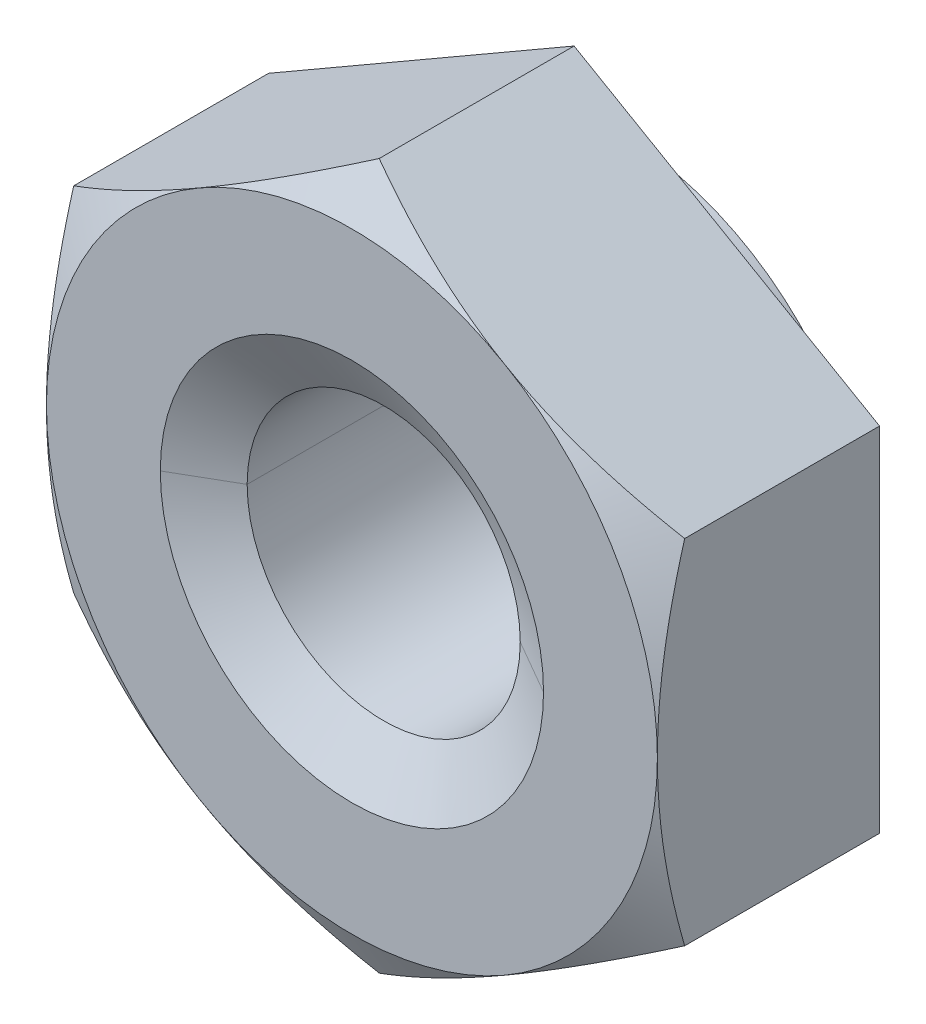
ISO-10303-21;
HEADER;
FILE_DESCRIPTION(('STEP AP214'),'2;1');
FILE_NAME('part.step','',(''),(''),'','','');
FILE_SCHEMA(('AUTOMOTIVE_DESIGN { 1 0 10303 214 1 1 1 1 }'));
ENDSEC;
DATA;
#1=APPLICATION_CONTEXT('core data for automotive mechanical design processes');
#2=APPLICATION_PROTOCOL_DEFINITION('international standard','automotive_design',2000,#1);
#3=PRODUCT_CONTEXT('',#1,'mechanical');
#4=PRODUCT('Part','Part','',(#3));
#5=PRODUCT_RELATED_PRODUCT_CATEGORY('part','',(#4));
#6=PRODUCT_DEFINITION_FORMATION('','',#4);
#7=PRODUCT_DEFINITION_CONTEXT('part definition',#1,'design');
#8=PRODUCT_DEFINITION('design','',#6,#7);
#9=PRODUCT_DEFINITION_SHAPE('','',#8);
#10=(LENGTH_UNIT() NAMED_UNIT(*) SI_UNIT(.MILLI.,.METRE.));
#11=(NAMED_UNIT(*) PLANE_ANGLE_UNIT() SI_UNIT($,.RADIAN.));
#12=(NAMED_UNIT(*) SI_UNIT($,.STERADIAN.) SOLID_ANGLE_UNIT());
#13=UNCERTAINTY_MEASURE_WITH_UNIT(LENGTH_MEASURE(1.E-05),#10,'distance_accuracy_value','');
#14=(GEOMETRIC_REPRESENTATION_CONTEXT(3) GLOBAL_UNCERTAINTY_ASSIGNED_CONTEXT((#13)) GLOBAL_UNIT_ASSIGNED_CONTEXT((#10,
#11,#12)) REPRESENTATION_CONTEXT('',''));
#15=CARTESIAN_POINT('',(0.,0.,0.));
#16=DIRECTION('',(0.,0.,1.));
#17=DIRECTION('',(1.,0.,0.));
#18=AXIS2_PLACEMENT_3D('',#15,#16,#17);
#19=CARTESIAN_POINT('',(0.,-2.3,-2.));
#20=DIRECTION('',(0.,0.,-1.));
#21=DIRECTION('',(0.,-1.,0.));
#22=AXIS2_PLACEMENT_3D('',#19,#20,#21);
#23=PLANE('',#22);
#24=CARTESIAN_POINT('',(0.,0.,-2.));
#25=DIRECTION('',(0.,0.,1.));
#26=DIRECTION('',(1.,0.,0.));
#27=AXIS2_PLACEMENT_3D('',#24,#25,#26);
#28=CIRCLE('',#27,2.3);
#29=CARTESIAN_POINT('',(2.3,0.,-2.));
#30=VERTEX_POINT('',#29);
#31=CARTESIAN_POINT('',(-2.3,0.,-2.));
#32=VERTEX_POINT('',#31);
#33=EDGE_CURVE('E428',#30,#32,#28,.T.);
#34=ORIENTED_EDGE('',*,*,#33,.T.);
#35=CARTESIAN_POINT('',(0.,0.,-2.));
#36=DIRECTION('',(0.,0.,1.));
#37=DIRECTION('',(1.,0.,0.));
#38=AXIS2_PLACEMENT_3D('',#35,#36,#37);
#39=CIRCLE('',#38,2.3);
#40=EDGE_CURVE('E11',#32,#30,#39,.T.);
#41=ORIENTED_EDGE('',*,*,#40,.T.);
#42=EDGE_LOOP('',(#34,#41));
#43=FACE_BOUND('',#42,.T.);
#44=DIRECTION('',(0.,1.,0.));
#45=VECTOR('',#44,1.);
#46=CARTESIAN_POINT('',(2.75,-1.58771324027147,-2.));
#47=LINE('',#46,#45);
#48=CARTESIAN_POINT('',(2.75,-1.58771324027148,-2.));
#49=VERTEX_POINT('',#48);
#50=CARTESIAN_POINT('',(2.75,1.58771324027146,-2.));
#51=VERTEX_POINT('',#50);
#52=EDGE_CURVE('E395',#49,#51,#47,.T.);
#53=ORIENTED_EDGE('',*,*,#52,.F.);
#54=DIRECTION('',(0.86602540378444,0.5,0.));
#55=VECTOR('',#54,1.);
#56=CARTESIAN_POINT('',(0.,-3.17542648054294,-2.));
#57=LINE('',#56,#55);
#58=CARTESIAN_POINT('',(0.,-3.17542648054294,-2.));
#59=VERTEX_POINT('',#58);
#60=EDGE_CURVE('E225',#59,#49,#57,.T.);
#61=ORIENTED_EDGE('',*,*,#60,.F.);
#62=DIRECTION('',(0.866025403784437,-0.5,0.));
#63=VECTOR('',#62,1.);
#64=CARTESIAN_POINT('',(-2.75,-1.58771324027146,-2.));
#65=LINE('',#64,#63);
#66=CARTESIAN_POINT('',(-2.75,-1.58771324027146,-2.));
#67=VERTEX_POINT('',#66);
#68=EDGE_CURVE('E205',#67,#59,#65,.T.);
#69=ORIENTED_EDGE('',*,*,#68,.F.);
#70=DIRECTION('',(0.,-1.,0.));
#71=VECTOR('',#70,1.);
#72=CARTESIAN_POINT('',(-2.75,1.58771324027148,-2.));
#73=LINE('',#72,#71);
#74=CARTESIAN_POINT('',(-2.75,1.58771324027148,-2.));
#75=VERTEX_POINT('',#74);
#76=EDGE_CURVE('E482',#75,#67,#73,.T.);
#77=ORIENTED_EDGE('',*,*,#76,.F.);
#78=DIRECTION('',(-0.86602540378444,-0.5,0.));
#79=VECTOR('',#78,1.);
#80=CARTESIAN_POINT('',(0.,3.17542648054294,-2.));
#81=LINE('',#80,#79);
#82=CARTESIAN_POINT('',(0.,3.17542648054294,-2.));
#83=VERTEX_POINT('',#82);
#84=EDGE_CURVE('E107',#83,#75,#81,.T.);
#85=ORIENTED_EDGE('',*,*,#84,.F.);
#86=DIRECTION('',(-0.866025403784437,0.5,0.));
#87=VECTOR('',#86,1.);
#88=CARTESIAN_POINT('',(2.75,1.58771324027145,-2.));
#89=LINE('',#88,#87);
#90=EDGE_CURVE('E396',#51,#83,#89,.T.);
#91=ORIENTED_EDGE('',*,*,#90,.F.);
#92=EDGE_LOOP('',(#53,#61,#69,#77,#85,#91));
#93=FACE_BOUND('',#92,.T.);
#94=ADVANCED_FACE('F17',(#43,#93),#23,.T.);
#95=CARTESIAN_POINT('',(0.,0.,0.));
#96=DIRECTION('',(0.,0.,1.));
#97=DIRECTION('',(1.,0.,0.));
#98=AXIS2_PLACEMENT_3D('',#95,#96,#97);
#99=CYLINDRICAL_SURFACE('',#98,2.3);
#100=DIRECTION('',(0.,0.,1.));
#101=VECTOR('',#100,1.);
#102=CARTESIAN_POINT('',(-2.3,0.,0.));
#103=LINE('',#102,#101);
#104=CARTESIAN_POINT('',(-2.3,0.,-2.4));
#105=VERTEX_POINT('',#104);
#106=EDGE_CURVE('E424',#105,#32,#103,.T.);
#107=ORIENTED_EDGE('',*,*,#106,.F.);
#108=CARTESIAN_POINT('',(0.,0.,-2.4));
#109=DIRECTION('',(0.,0.,1.));
#110=DIRECTION('',(1.,0.,0.));
#111=AXIS2_PLACEMENT_3D('',#108,#109,#110);
#112=CIRCLE('',#111,2.3);
#113=CARTESIAN_POINT('',(2.3,0.,-2.4));
#114=VERTEX_POINT('',#113);
#115=EDGE_CURVE('E433',#105,#114,#112,.T.);
#116=ORIENTED_EDGE('',*,*,#115,.T.);
#117=DIRECTION('',(0.,0.,1.));
#118=VECTOR('',#117,1.);
#119=CARTESIAN_POINT('',(2.3,0.,0.));
#120=LINE('',#119,#118);
#121=EDGE_CURVE('E873',#114,#30,#120,.T.);
#122=ORIENTED_EDGE('',*,*,#121,.T.);
#123=ORIENTED_EDGE('',*,*,#40,.F.);
#124=EDGE_LOOP('',(#107,#116,#122,#123));
#125=FACE_BOUND('',#124,.T.);
#126=ADVANCED_FACE('F344',(#125),#99,.T.);
#127=CARTESIAN_POINT('',(0.,0.,0.));
#128=DIRECTION('',(0.,0.,-1.));
#129=DIRECTION('',(1.,0.,0.));
#130=AXIS2_PLACEMENT_3D('',#127,#128,#129);
#131=CONICAL_SURFACE('',#130,2.75,1.0471975511966);
#132=CARTESIAN_POINT('',(0.,0.,0.));
#133=DIRECTION('',(0.,0.,1.));
#134=DIRECTION('',(1.,0.,0.));
#135=AXIS2_PLACEMENT_3D('',#132,#133,#134);
#136=CIRCLE('',#135,2.75);
#137=CARTESIAN_POINT('',(2.75,0.,0.));
#138=VERTEX_POINT('',#137);
#139=CARTESIAN_POINT('',(1.375,2.3815698604072,0.));
#140=VERTEX_POINT('',#139);
#141=EDGE_CURVE('E271',#138,#140,#136,.T.);
#142=ORIENTED_EDGE('',*,*,#141,.F.);
#143=CARTESIAN_POINT('',(2.75000000000001,1.58771324027145,-0.24562009306186));
#144=CARTESIAN_POINT('',(2.75000000000001,1.17700711208503,-0.127059446228729));
#145=CARTESIAN_POINT('',(2.75000000000001,0.80581810971201,-0.0667597700795448));
#146=CARTESIAN_POINT('',(2.75000000000001,0.39486246223607,0.));
#147=CARTESIAN_POINT('',(2.75000000000001,0.,0.));
#148=B_SPLINE_CURVE_WITH_KNOTS('',2,(#143,#144,#145,#146,#147),.UNSPECIFIED.,.F.,.F.,(3,2,3),
(0.,0.5,1.),.UNSPECIFIED.);
#149=CARTESIAN_POINT('',(2.75,1.58771324027145,-0.245620093061859));
#150=VERTEX_POINT('',#149);
#151=EDGE_CURVE('E236',#150,#138,#148,.T.);
#152=ORIENTED_EDGE('',*,*,#151,.F.);
#153=CARTESIAN_POINT('',(1.37499999999999,2.38156986040719,0.));
#154=CARTESIAN_POINT('',(1.71537571429377,2.18505385013407,0.));
#155=CARTESIAN_POINT('',(2.07042661145691,1.98006511908091,-0.0663045175160796));
#156=CARTESIAN_POINT('',(2.39248072027393,1.79412709266178,-0.126446999818754));
#157=CARTESIAN_POINT('',(2.75,1.58771324027145,-0.24562009306186));
#158=B_SPLINE_CURVE_WITH_KNOTS('',2,(#153,#154,#155,#156,#157),.UNSPECIFIED.,.F.,.F.,(3,2,3),
(0.,0.5,1.),.UNSPECIFIED.);
#159=EDGE_CURVE('E387',#140,#150,#158,.T.);
#160=ORIENTED_EDGE('',*,*,#159,.F.);
#161=EDGE_LOOP('',(#142,#152,#160));
#162=FACE_BOUND('',#161,.T.);
#163=ADVANCED_FACE('F335',(#162),#131,.T.);
#164=CARTESIAN_POINT('',(0.,0.,0.));
#165=DIRECTION('',(0.,0.,-1.));
#166=DIRECTION('',(1.,0.,0.));
#167=AXIS2_PLACEMENT_3D('',#164,#165,#166);
#168=CONICAL_SURFACE('',#167,2.75,1.0471975511966);
#169=CARTESIAN_POINT('',(0.,0.,0.));
#170=DIRECTION('',(0.,0.,1.));
#171=DIRECTION('',(1.,0.,0.));
#172=AXIS2_PLACEMENT_3D('',#169,#170,#171);
#173=CIRCLE('',#172,2.75);
#174=CARTESIAN_POINT('',(1.375,-2.38156986040721,0.));
#175=VERTEX_POINT('',#174);
#176=EDGE_CURVE('E262',#175,#138,#173,.T.);
#177=ORIENTED_EDGE('',*,*,#176,.F.);
#178=CARTESIAN_POINT('',(2.75,-1.58771324027147,-0.24562009306186));
#179=CARTESIAN_POINT('',(2.01313972082094,-2.01313972081064,0.));
#180=CARTESIAN_POINT('',(1.37499999999999,-2.3815698604072,0.));
#181=B_SPLINE_CURVE_WITH_KNOTS('',2,(#178,#179,#180),.UNSPECIFIED.,.F.,.F.,(3,3),(0.,1.),.UNSPECIFIED.);
#182=CARTESIAN_POINT('',(2.75,-1.58771324027147,-0.245620093061859));
#183=VERTEX_POINT('',#182);
#184=EDGE_CURVE('E214',#183,#175,#181,.T.);
#185=ORIENTED_EDGE('',*,*,#184,.F.);
#186=CARTESIAN_POINT('',(2.75000000000001,0.,0.));
#187=CARTESIAN_POINT('',(2.75,-0.391595094571537,0.));
#188=CARTESIAN_POINT('',(2.75,-0.799945605578829,-0.0658095618981747));
#189=CARTESIAN_POINT('',(2.75,-1.17322057595631,-0.125966367402105));
#190=CARTESIAN_POINT('',(2.75,-1.58771324027147,-0.24562009306186));
#191=B_SPLINE_CURVE_WITH_KNOTS('',2,(#186,#187,#188,#189,#190),.UNSPECIFIED.,.F.,.F.,(3,2,3),
(0.,0.5,1.),.UNSPECIFIED.);
#192=EDGE_CURVE('E226',#138,#183,#191,.T.);
#193=ORIENTED_EDGE('',*,*,#192,.F.);
#194=EDGE_LOOP('',(#177,#185,#193));
#195=FACE_BOUND('',#194,.T.);
#196=ADVANCED_FACE('F251',(#195),#168,.T.);
#197=CARTESIAN_POINT('',(0.,0.,0.));
#198=DIRECTION('',(0.,0.,-1.));
#199=DIRECTION('',(1.,0.,0.));
#200=AXIS2_PLACEMENT_3D('',#197,#198,#199);
#201=CONICAL_SURFACE('',#200,2.75,1.0471975511966);
#202=CARTESIAN_POINT('',(0.,0.,0.));
#203=DIRECTION('',(0.,0.,1.));
#204=DIRECTION('',(1.,0.,0.));
#205=AXIS2_PLACEMENT_3D('',#202,#203,#204);
#206=CIRCLE('',#205,2.75);
#207=CARTESIAN_POINT('',(-1.375,-2.3815698604072,0.));
#208=VERTEX_POINT('',#207);
#209=EDGE_CURVE('E197',#208,#175,#206,.T.);
#210=ORIENTED_EDGE('',*,*,#209,.F.);
#211=CARTESIAN_POINT('',(0.,-3.17542648054293,-0.245620093061866));
#212=CARTESIAN_POINT('',(-0.736860279179043,-2.75000000000376,0.));
#213=CARTESIAN_POINT('',(-1.37499999999999,-2.3815698604072,0.));
#214=B_SPLINE_CURVE_WITH_KNOTS('',2,(#211,#212,#213),.UNSPECIFIED.,.F.,.F.,(3,3),(0.,1.),.UNSPECIFIED.);
#215=CARTESIAN_POINT('',(0.,-3.17542648054294,-0.245620093061859));
#216=VERTEX_POINT('',#215);
#217=EDGE_CURVE('E190',#216,#208,#214,.T.);
#218=ORIENTED_EDGE('',*,*,#217,.F.);
#219=CARTESIAN_POINT('',(1.37499999999999,-2.3815698604072,0.));
#220=CARTESIAN_POINT('',(1.03462428570698,-2.57808587067989,0.));
#221=CARTESIAN_POINT('',(0.679573388543084,-2.78307460173348,-0.0663045175160796));
#222=CARTESIAN_POINT('',(0.357519279726927,-2.96901262815211,-0.126446999818469));
#223=CARTESIAN_POINT('',(0.,-3.17542648054294,-0.24562009306186));
#224=B_SPLINE_CURVE_WITH_KNOTS('',2,(#219,#220,#221,#222,#223),.UNSPECIFIED.,.F.,.F.,(3,2,3),
(0.,0.5,1.),.UNSPECIFIED.);
#225=EDGE_CURVE('E194',#175,#216,#224,.T.);
#226=ORIENTED_EDGE('',*,*,#225,.F.);
#227=EDGE_LOOP('',(#210,#218,#226));
#228=FACE_BOUND('',#227,.T.);
#229=ADVANCED_FACE('F193',(#228),#201,.T.);
#230=CARTESIAN_POINT('',(0.,0.,0.));
#231=DIRECTION('',(0.,0.,-1.));
#232=DIRECTION('',(1.,0.,0.));
#233=AXIS2_PLACEMENT_3D('',#230,#231,#232);
#234=CONICAL_SURFACE('',#233,2.75,1.0471975511966);
#235=CARTESIAN_POINT('',(0.,0.,0.));
#236=DIRECTION('',(0.,0.,1.));
#237=DIRECTION('',(1.,0.,0.));
#238=AXIS2_PLACEMENT_3D('',#235,#236,#237);
#239=CIRCLE('',#238,2.75);
#240=CARTESIAN_POINT('',(-2.75,0.,0.));
#241=VERTEX_POINT('',#240);
#242=EDGE_CURVE('E550',#241,#208,#239,.T.);
#243=ORIENTED_EDGE('',*,*,#242,.F.);
#244=CARTESIAN_POINT('',(-2.75000000000001,-1.58771324027208,-0.245620093061445));
#245=CARTESIAN_POINT('',(-2.75000000000001,-1.17381427037922,-0.12613775221989));
#246=CARTESIAN_POINT('',(-2.75000000000001,-0.799945605579045,-0.0658095618982098));
#247=CARTESIAN_POINT('',(-2.75000000000001,-0.392107530099285,0.));
#248=CARTESIAN_POINT('',(-2.75000000000001,0.,0.));
#249=B_SPLINE_CURVE_WITH_KNOTS('',2,(#244,#245,#246,#247,#248),.UNSPECIFIED.,.F.,.F.,(3,2,3),
(0.,0.5,1.),.UNSPECIFIED.);
#250=CARTESIAN_POINT('',(-2.75,-1.58771324027208,-0.245620093061443));
#251=VERTEX_POINT('',#250);
#252=EDGE_CURVE('E516',#251,#241,#249,.T.);
#253=ORIENTED_EDGE('',*,*,#252,.F.);
#254=CARTESIAN_POINT('',(-1.37499999999999,-2.3815698604072,0.));
#255=CARTESIAN_POINT('',(-1.71537571429273,-2.18505385013467,0.));
#256=CARTESIAN_POINT('',(-2.07042661145675,-1.98006511908101,-0.0663045175160566));
#257=CARTESIAN_POINT('',(-2.39248072027127,-1.79412709266332,-0.126446999818092));
#258=CARTESIAN_POINT('',(-2.74999999999973,-1.58771324027161,-0.245620093061451));
#259=B_SPLINE_CURVE_WITH_KNOTS('',2,(#254,#255,#256,#257,#258),.UNSPECIFIED.,.F.,.F.,(3,2,3),
(0.,0.5,1.),.UNSPECIFIED.);
#260=EDGE_CURVE('E204',#208,#251,#259,.T.);
#261=ORIENTED_EDGE('',*,*,#260,.F.);
#262=EDGE_LOOP('',(#243,#253,#261));
#263=FACE_BOUND('',#262,.T.);
#264=ADVANCED_FACE('F250',(#263),#234,.T.);
#265=CARTESIAN_POINT('',(0.,0.,0.));
#266=DIRECTION('',(0.,0.,-1.));
#267=DIRECTION('',(1.,0.,0.));
#268=AXIS2_PLACEMENT_3D('',#265,#266,#267);
#269=CONICAL_SURFACE('',#268,2.75,1.0471975511966);
#270=CARTESIAN_POINT('',(0.,0.,0.));
#271=DIRECTION('',(0.,0.,1.));
#272=DIRECTION('',(1.,0.,0.));
#273=AXIS2_PLACEMENT_3D('',#270,#271,#272);
#274=CIRCLE('',#273,2.75);
#275=CARTESIAN_POINT('',(-1.375,2.38156986040721,0.));
#276=VERTEX_POINT('',#275);
#277=EDGE_CURVE('E45',#276,#241,#274,.T.);
#278=ORIENTED_EDGE('',*,*,#277,.F.);
#279=CARTESIAN_POINT('',(-2.75,1.58771324027147,-0.24562009306186));
#280=CARTESIAN_POINT('',(-2.01313972082094,2.01313972081064,0.));
#281=CARTESIAN_POINT('',(-1.375,2.38156986040721,0.));
#282=B_SPLINE_CURVE_WITH_KNOTS('',2,(#279,#280,#281),.UNSPECIFIED.,.F.,.F.,(3,3),(0.,1.),.UNSPECIFIED.);
#283=CARTESIAN_POINT('',(-2.75,1.58771324027148,-0.245620093061861));
#284=VERTEX_POINT('',#283);
#285=EDGE_CURVE('E468',#284,#276,#282,.T.);
#286=ORIENTED_EDGE('',*,*,#285,.F.);
#287=CARTESIAN_POINT('',(-2.75000000000001,0.,0.));
#288=CARTESIAN_POINT('',(-2.75,0.394350180617206,0.));
#289=CARTESIAN_POINT('',(-2.75,0.80581810971206,-0.06675977007955));
#290=CARTESIAN_POINT('',(-2.75,1.17641330303536,-0.126888028321385));
#291=CARTESIAN_POINT('',(-2.75,1.58771324027148,-0.24562009306186));
#292=B_SPLINE_CURVE_WITH_KNOTS('',2,(#287,#288,#289,#290,#291),.UNSPECIFIED.,.F.,.F.,(3,2,3),
(0.,0.5,1.),.UNSPECIFIED.);
#293=EDGE_CURVE('E489',#241,#284,#292,.T.);
#294=ORIENTED_EDGE('',*,*,#293,.F.);
#295=EDGE_LOOP('',(#278,#286,#294));
#296=FACE_BOUND('',#295,.T.);
#297=ADVANCED_FACE('F252',(#296),#269,.T.);
#298=CARTESIAN_POINT('',(0.,0.,0.));
#299=DIRECTION('',(0.,0.,-1.));
#300=DIRECTION('',(1.,0.,0.));
#301=AXIS2_PLACEMENT_3D('',#298,#299,#300);
#302=CONICAL_SURFACE('',#301,2.75,1.0471975511966);
#303=CARTESIAN_POINT('',(-1.375,2.38156986040721,0.));
#304=CARTESIAN_POINT('',(-1.03462428570702,2.57808587067987,0.));
#305=CARTESIAN_POINT('',(-0.679573388543087,2.78307460173348,-0.0663045175160848));
#306=CARTESIAN_POINT('',(-0.35751927972697,2.96901262815209,-0.126446999818459));
#307=CARTESIAN_POINT('',(0.,3.17542648054294,-0.24562009306186));
#308=B_SPLINE_CURVE_WITH_KNOTS('',2,(#303,#304,#305,#306,#307),.UNSPECIFIED.,.F.,.F.,(3,2,3),
(0.,0.5,1.),.UNSPECIFIED.);
#309=CARTESIAN_POINT('',(0.,3.17542648054294,-0.245620093061859));
#310=VERTEX_POINT('',#309);
#311=EDGE_CURVE('E92',#276,#310,#308,.T.);
#312=ORIENTED_EDGE('',*,*,#311,.F.);
#313=CARTESIAN_POINT('',(0.,0.,0.));
#314=DIRECTION('',(0.,0.,1.));
#315=DIRECTION('',(1.,0.,0.));
#316=AXIS2_PLACEMENT_3D('',#313,#314,#315);
#317=CIRCLE('',#316,2.75);
#318=EDGE_CURVE('E568',#140,#276,#317,.T.);
#319=ORIENTED_EDGE('',*,*,#318,.F.);
#320=CARTESIAN_POINT('',(0.,3.17542648054293,-0.24562009306186));
#321=CARTESIAN_POINT('',(0.73686027917903,2.75000000000377,0.));
#322=CARTESIAN_POINT('',(1.37499999999999,2.38156986040719,0.));
#323=B_SPLINE_CURVE_WITH_KNOTS('',2,(#320,#321,#322),.UNSPECIFIED.,.F.,.F.,(3,3),(0.,1.),.UNSPECIFIED.);
#324=EDGE_CURVE('E361',#310,#140,#323,.T.);
#325=ORIENTED_EDGE('',*,*,#324,.F.);
#326=EDGE_LOOP('',(#312,#319,#325));
#327=FACE_BOUND('',#326,.T.);
#328=ADVANCED_FACE('F19',(#327),#302,.T.);
#329=CARTESIAN_POINT('',(0.,0.,-2.4));
#330=DIRECTION('',(0.,0.,-1.));
#331=DIRECTION('',(-1.,0.,0.));
#332=AXIS2_PLACEMENT_3D('',#329,#330,#331);
#333=CONICAL_SURFACE('',#332,1.725,1.0471975511966);
#334=DIRECTION('',(0.86602540378444,0.,-0.5));
#335=VECTOR('',#334,1.);
#336=CARTESIAN_POINT('',(1.725,0.,-2.4));
#337=LINE('',#336,#335);
#338=CARTESIAN_POINT('',(1.229375,0.,-2.11385077283289));
#339=VERTEX_POINT('',#338);
#340=CARTESIAN_POINT('',(1.725,0.,-2.4));
#341=VERTEX_POINT('',#340);
#342=EDGE_CURVE('E907',#339,#341,#337,.T.);
#343=ORIENTED_EDGE('',*,*,#342,.F.);
#344=CARTESIAN_POINT('',(0.,0.,-2.11385077283289));
#345=DIRECTION('',(0.,0.,1.));
#346=DIRECTION('',(1.,0.,0.));
#347=AXIS2_PLACEMENT_3D('',#344,#345,#346);
#348=CIRCLE('',#347,1.229375);
#349=CARTESIAN_POINT('',(-1.229375,0.,-2.11385077283289));
#350=VERTEX_POINT('',#349);
#351=EDGE_CURVE('E431',#339,#350,#348,.T.);
#352=ORIENTED_EDGE('',*,*,#351,.T.);
#353=DIRECTION('',(-0.86602540378444,0.,-0.5));
#354=VECTOR('',#353,1.);
#355=CARTESIAN_POINT('',(-1.725,0.,-2.4));
#356=LINE('',#355,#354);
#357=CARTESIAN_POINT('',(-1.725,0.,-2.4));
#358=VERTEX_POINT('',#357);
#359=EDGE_CURVE('E423',#350,#358,#356,.T.);
#360=ORIENTED_EDGE('',*,*,#359,.T.);
#361=CARTESIAN_POINT('',(0.,0.,-2.4));
#362=DIRECTION('',(0.,0.,1.));
#363=DIRECTION('',(1.,0.,0.));
#364=AXIS2_PLACEMENT_3D('',#361,#362,#363);
#365=CIRCLE('',#364,1.725);
#366=EDGE_CURVE('E272',#341,#358,#365,.T.);
#367=ORIENTED_EDGE('',*,*,#366,.F.);
#368=EDGE_LOOP('',(#343,#352,#360,#367));
#369=FACE_BOUND('',#368,.T.);
#370=ADVANCED_FACE('F376',(#369),#333,.F.);
#371=CARTESIAN_POINT('',(0.,0.,-0.286149227167106));
#372=DIRECTION('',(0.,0.,1.));
#373=DIRECTION('',(1.,0.,0.));
#374=AXIS2_PLACEMENT_3D('',#371,#372,#373);
#375=CONICAL_SURFACE('',#374,1.229375,1.0471975511966);
#376=DIRECTION('',(-0.866025403784439,0.,0.5));
#377=VECTOR('',#376,1.);
#378=CARTESIAN_POINT('',(-1.229375,0.,-0.286149227167106));
#379=LINE('',#378,#377);
#380=CARTESIAN_POINT('',(-1.229375,0.,-0.286149227167106));
#381=VERTEX_POINT('',#380);
#382=CARTESIAN_POINT('',(-1.725,0.,0.));
#383=VERTEX_POINT('',#382);
#384=EDGE_CURVE('E422',#381,#383,#379,.T.);
#385=ORIENTED_EDGE('',*,*,#384,.F.);
#386=CARTESIAN_POINT('',(0.,0.,-0.286149227167106));
#387=DIRECTION('',(0.,0.,1.));
#388=DIRECTION('',(1.,0.,0.));
#389=AXIS2_PLACEMENT_3D('',#386,#387,#388);
#390=CIRCLE('',#389,1.229375);
#391=CARTESIAN_POINT('',(1.229375,0.,-0.286149227167106));
#392=VERTEX_POINT('',#391);
#393=EDGE_CURVE('E30',#392,#381,#390,.T.);
#394=ORIENTED_EDGE('',*,*,#393,.F.);
#395=DIRECTION('',(0.866025403784439,0.,0.5));
#396=VECTOR('',#395,1.);
#397=CARTESIAN_POINT('',(1.229375,0.,-0.286149227167106));
#398=LINE('',#397,#396);
#399=CARTESIAN_POINT('',(1.725,0.,0.));
#400=VERTEX_POINT('',#399);
#401=EDGE_CURVE('E413',#392,#400,#398,.T.);
#402=ORIENTED_EDGE('',*,*,#401,.T.);
#403=CARTESIAN_POINT('',(0.,0.,0.));
#404=DIRECTION('',(0.,0.,1.));
#405=DIRECTION('',(1.,0.,0.));
#406=AXIS2_PLACEMENT_3D('',#403,#404,#405);
#407=CIRCLE('',#406,1.725);
#408=EDGE_CURVE('E159',#400,#383,#407,.T.);
#409=ORIENTED_EDGE('',*,*,#408,.T.);
#410=EDGE_LOOP('',(#385,#394,#402,#409));
#411=FACE_BOUND('',#410,.T.);
#412=ADVANCED_FACE('F659',(#411),#375,.F.);
#413=CARTESIAN_POINT('',(0.,0.,-2.4));
#414=DIRECTION('',(0.,0.,1.));
#415=DIRECTION('',(1.,0.,0.));
#416=AXIS2_PLACEMENT_3D('',#413,#414,#415);
#417=CYLINDRICAL_SURFACE('',#416,1.229375);
#418=DIRECTION('',(0.,0.,1.));
#419=VECTOR('',#418,1.);
#420=CARTESIAN_POINT('',(-1.229375,0.,-2.4));
#421=LINE('',#420,#419);
#422=EDGE_CURVE('E404',#350,#381,#421,.T.);
#423=ORIENTED_EDGE('',*,*,#422,.F.);
#424=ORIENTED_EDGE('',*,*,#351,.F.);
#425=DIRECTION('',(0.,0.,1.));
#426=VECTOR('',#425,1.);
#427=CARTESIAN_POINT('',(1.229375,0.,-2.4));
#428=LINE('',#427,#426);
#429=EDGE_CURVE('E397',#339,#392,#428,.T.);
#430=ORIENTED_EDGE('',*,*,#429,.T.);
#431=ORIENTED_EDGE('',*,*,#393,.T.);
#432=EDGE_LOOP('',(#423,#424,#430,#431));
#433=FACE_BOUND('',#432,.T.);
#434=ADVANCED_FACE('F663',(#433),#417,.F.);
#435=CARTESIAN_POINT('',(0.,3.17542648054294,0.));
#436=DIRECTION('',(0.,0.,1.));
#437=DIRECTION('',(1.,0.,0.));
#438=AXIS2_PLACEMENT_3D('',#435,#436,#437);
#439=PLANE('',#438);
#440=ORIENTED_EDGE('',*,*,#408,.F.);
#441=CARTESIAN_POINT('',(0.,0.,0.));
#442=DIRECTION('',(0.,0.,1.));
#443=DIRECTION('',(1.,0.,0.));
#444=AXIS2_PLACEMENT_3D('',#441,#442,#443);
#445=CIRCLE('',#444,1.725);
#446=EDGE_CURVE('E890',#383,#400,#445,.T.);
#447=ORIENTED_EDGE('',*,*,#446,.F.);
#448=EDGE_LOOP('',(#440,#447));
#449=FACE_BOUND('',#448,.T.);
#450=ORIENTED_EDGE('',*,*,#176,.T.);
#451=ORIENTED_EDGE('',*,*,#141,.T.);
#452=ORIENTED_EDGE('',*,*,#318,.T.);
#453=ORIENTED_EDGE('',*,*,#277,.T.);
#454=ORIENTED_EDGE('',*,*,#242,.T.);
#455=ORIENTED_EDGE('',*,*,#209,.T.);
#456=EDGE_LOOP('',(#450,#451,#452,#453,#454,#455));
#457=FACE_BOUND('',#456,.T.);
#458=ADVANCED_FACE('F679',(#449,#457),#439,.T.);
#459=CARTESIAN_POINT('',(0.,3.17542648054294,-2.4));
#460=DIRECTION('',(0.,0.,1.));
#461=DIRECTION('',(1.,0.,0.));
#462=AXIS2_PLACEMENT_3D('',#459,#460,#461);
#463=PLANE('',#462);
#464=CARTESIAN_POINT('',(0.,0.,-2.4));
#465=DIRECTION('',(0.,0.,1.));
#466=DIRECTION('',(1.,0.,0.));
#467=AXIS2_PLACEMENT_3D('',#464,#465,#466);
#468=CIRCLE('',#467,1.725);
#469=EDGE_CURVE('E899',#358,#341,#468,.T.);
#470=ORIENTED_EDGE('',*,*,#469,.T.);
#471=ORIENTED_EDGE('',*,*,#366,.T.);
#472=EDGE_LOOP('',(#470,#471));
#473=FACE_BOUND('',#472,.T.);
#474=CARTESIAN_POINT('',(0.,0.,-2.4));
#475=DIRECTION('',(0.,0.,1.));
#476=DIRECTION('',(1.,0.,0.));
#477=AXIS2_PLACEMENT_3D('',#474,#475,#476);
#478=CIRCLE('',#477,2.3);
#479=EDGE_CURVE('E429',#114,#105,#478,.T.);
#480=ORIENTED_EDGE('',*,*,#479,.F.);
#481=ORIENTED_EDGE('',*,*,#115,.F.);
#482=EDGE_LOOP('',(#480,#481));
#483=FACE_BOUND('',#482,.T.);
#484=ADVANCED_FACE('F374',(#473,#483),#463,.F.);
#485=CARTESIAN_POINT('',(0.,3.17542648054294,-2.4));
#486=DIRECTION('',(-0.5,0.86602540378444,0.));
#487=DIRECTION('',(0.,0.,1.));
#488=AXIS2_PLACEMENT_3D('',#485,#486,#487);
#489=PLANE('',#488);
#490=DIRECTION('',(0.,0.,1.));
#491=VECTOR('',#490,1.);
#492=CARTESIAN_POINT('',(0.,3.17542648054294,-2.4));
#493=LINE('',#492,#491);
#494=EDGE_CURVE('E401',#83,#310,#493,.T.);
#495=ORIENTED_EDGE('',*,*,#494,.F.);
#496=ORIENTED_EDGE('',*,*,#84,.T.);
#497=DIRECTION('',(0.,0.,1.));
#498=VECTOR('',#497,1.);
#499=CARTESIAN_POINT('',(-2.75,1.58771324027148,-2.4));
#500=LINE('',#499,#498);
#501=EDGE_CURVE('E473',#75,#284,#500,.T.);
#502=ORIENTED_EDGE('',*,*,#501,.T.);
#503=ORIENTED_EDGE('',*,*,#285,.T.);
#504=ORIENTED_EDGE('',*,*,#311,.T.);
#505=EDGE_LOOP('',(#495,#496,#502,#503,#504));
#506=FACE_BOUND('',#505,.T.);
#507=ADVANCED_FACE('F441',(#506),#489,.T.);
#508=CARTESIAN_POINT('',(-2.75,1.58771324027148,-2.4));
#509=DIRECTION('',(-1.,0.,0.));
#510=DIRECTION('',(0.,0.,1.));
#511=AXIS2_PLACEMENT_3D('',#508,#509,#510);
#512=PLANE('',#511);
#513=ORIENTED_EDGE('',*,*,#501,.F.);
#514=ORIENTED_EDGE('',*,*,#76,.T.);
#515=DIRECTION('',(0.,0.,1.));
#516=VECTOR('',#515,1.);
#517=CARTESIAN_POINT('',(-2.75,-1.58771324027146,-2.4));
#518=LINE('',#517,#516);
#519=EDGE_CURVE('E217',#67,#251,#518,.T.);
#520=ORIENTED_EDGE('',*,*,#519,.T.);
#521=ORIENTED_EDGE('',*,*,#252,.T.);
#522=ORIENTED_EDGE('',*,*,#293,.T.);
#523=EDGE_LOOP('',(#513,#514,#520,#521,#522));
#524=FACE_BOUND('',#523,.T.);
#525=ADVANCED_FACE('F451',(#524),#512,.T.);
#526=CARTESIAN_POINT('',(-2.75,-1.58771324027146,-2.4));
#527=DIRECTION('',(-0.5,-0.866025403784437,0.));
#528=DIRECTION('',(-0.866025403784437,0.5,0.));
#529=AXIS2_PLACEMENT_3D('',#526,#527,#528);
#530=PLANE('',#529);
#531=ORIENTED_EDGE('',*,*,#519,.F.);
#532=ORIENTED_EDGE('',*,*,#68,.T.);
#533=DIRECTION('',(0.,0.,1.));
#534=VECTOR('',#533,1.);
#535=CARTESIAN_POINT('',(0.,-3.17542648054294,-2.4));
#536=LINE('',#535,#534);
#537=EDGE_CURVE('E212',#59,#216,#536,.T.);
#538=ORIENTED_EDGE('',*,*,#537,.T.);
#539=ORIENTED_EDGE('',*,*,#217,.T.);
#540=ORIENTED_EDGE('',*,*,#260,.T.);
#541=EDGE_LOOP('',(#531,#532,#538,#539,#540));
#542=FACE_BOUND('',#541,.T.);
#543=ADVANCED_FACE('F221',(#542),#530,.T.);
#544=CARTESIAN_POINT('',(0.,-3.17542648054294,-2.4));
#545=DIRECTION('',(0.5,-0.86602540378444,0.));
#546=DIRECTION('',(0.,0.,-1.));
#547=AXIS2_PLACEMENT_3D('',#544,#545,#546);
#548=PLANE('',#547);
#549=ORIENTED_EDGE('',*,*,#537,.F.);
#550=ORIENTED_EDGE('',*,*,#60,.T.);
#551=DIRECTION('',(0.,0.,1.));
#552=VECTOR('',#551,1.);
#553=CARTESIAN_POINT('',(2.75,-1.58771324027147,-2.4));
#554=LINE('',#553,#552);
#555=EDGE_CURVE('E392',#49,#183,#554,.T.);
#556=ORIENTED_EDGE('',*,*,#555,.T.);
#557=ORIENTED_EDGE('',*,*,#184,.T.);
#558=ORIENTED_EDGE('',*,*,#225,.T.);
#559=EDGE_LOOP('',(#549,#550,#556,#557,#558));
#560=FACE_BOUND('',#559,.T.);
#561=ADVANCED_FACE('F211',(#560),#548,.T.);
#562=CARTESIAN_POINT('',(2.75,-1.58771324027147,-2.4));
#563=DIRECTION('',(1.,0.,0.));
#564=DIRECTION('',(0.,-1.,0.));
#565=AXIS2_PLACEMENT_3D('',#562,#563,#564);
#566=PLANE('',#565);
#567=ORIENTED_EDGE('',*,*,#555,.F.);
#568=ORIENTED_EDGE('',*,*,#52,.T.);
#569=DIRECTION('',(0.,0.,1.));
#570=VECTOR('',#569,1.);
#571=CARTESIAN_POINT('',(2.75,1.58771324027145,-2.4));
#572=LINE('',#571,#570);
#573=EDGE_CURVE('E333',#51,#150,#572,.T.);
#574=ORIENTED_EDGE('',*,*,#573,.T.);
#575=ORIENTED_EDGE('',*,*,#151,.T.);
#576=ORIENTED_EDGE('',*,*,#192,.T.);
#577=EDGE_LOOP('',(#567,#568,#574,#575,#576));
#578=FACE_BOUND('',#577,.T.);
#579=ADVANCED_FACE('F287',(#578),#566,.T.);
#580=CARTESIAN_POINT('',(2.75,1.58771324027145,-2.4));
#581=DIRECTION('',(0.5,0.866025403784437,0.));
#582=DIRECTION('',(0.,0.,-1.));
#583=AXIS2_PLACEMENT_3D('',#580,#581,#582);
#584=PLANE('',#583);
#585=ORIENTED_EDGE('',*,*,#573,.F.);
#586=ORIENTED_EDGE('',*,*,#90,.T.);
#587=ORIENTED_EDGE('',*,*,#494,.T.);
#588=ORIENTED_EDGE('',*,*,#324,.T.);
#589=ORIENTED_EDGE('',*,*,#159,.T.);
#590=EDGE_LOOP('',(#585,#586,#587,#588,#589));
#591=FACE_BOUND('',#590,.T.);
#592=ADVANCED_FACE('F305',(#591),#584,.T.);
#593=CARTESIAN_POINT('',(0.,0.,-2.4));
#594=DIRECTION('',(0.,0.,1.));
#595=DIRECTION('',(1.,0.,0.));
#596=AXIS2_PLACEMENT_3D('',#593,#594,#595);
#597=CYLINDRICAL_SURFACE('',#596,1.229375);
#598=CARTESIAN_POINT('',(0.,0.,-2.11385077283289));
#599=DIRECTION('',(0.,0.,1.));
#600=DIRECTION('',(1.,0.,0.));
#601=AXIS2_PLACEMENT_3D('',#598,#599,#600);
#602=CIRCLE('',#601,1.229375);
#603=EDGE_CURVE('E895',#350,#339,#602,.T.);
#604=ORIENTED_EDGE('',*,*,#603,.F.);
#605=ORIENTED_EDGE('',*,*,#422,.T.);
#606=CARTESIAN_POINT('',(0.,0.,-0.286149227167106));
#607=DIRECTION('',(0.,0.,1.));
#608=DIRECTION('',(1.,0.,0.));
#609=AXIS2_PLACEMENT_3D('',#606,#607,#608);
#610=CIRCLE('',#609,1.229375);
#611=EDGE_CURVE('E418',#381,#392,#610,.T.);
#612=ORIENTED_EDGE('',*,*,#611,.T.);
#613=ORIENTED_EDGE('',*,*,#429,.F.);
#614=EDGE_LOOP('',(#604,#605,#612,#613));
#615=FACE_BOUND('',#614,.T.);
#616=ADVANCED_FACE('F373',(#615),#597,.F.);
#617=CARTESIAN_POINT('',(0.,0.,-0.286149227167106));
#618=DIRECTION('',(0.,0.,1.));
#619=DIRECTION('',(1.,0.,0.));
#620=AXIS2_PLACEMENT_3D('',#617,#618,#619);
#621=CONICAL_SURFACE('',#620,1.229375,1.0471975511966);
#622=ORIENTED_EDGE('',*,*,#611,.F.);
#623=ORIENTED_EDGE('',*,*,#384,.T.);
#624=ORIENTED_EDGE('',*,*,#446,.T.);
#625=ORIENTED_EDGE('',*,*,#401,.F.);
#626=EDGE_LOOP('',(#622,#623,#624,#625));
#627=FACE_BOUND('',#626,.T.);
#628=ADVANCED_FACE('F300',(#627),#621,.F.);
#629=CARTESIAN_POINT('',(0.,0.,-2.4));
#630=DIRECTION('',(0.,0.,-1.));
#631=DIRECTION('',(-1.,0.,0.));
#632=AXIS2_PLACEMENT_3D('',#629,#630,#631);
#633=CONICAL_SURFACE('',#632,1.725,1.0471975511966);
#634=ORIENTED_EDGE('',*,*,#603,.T.);
#635=ORIENTED_EDGE('',*,*,#342,.T.);
#636=ORIENTED_EDGE('',*,*,#469,.F.);
#637=ORIENTED_EDGE('',*,*,#359,.F.);
#638=EDGE_LOOP('',(#634,#635,#636,#637));
#639=FACE_BOUND('',#638,.T.);
#640=ADVANCED_FACE('F288',(#639),#633,.F.);
#641=CARTESIAN_POINT('',(0.,0.,0.));
#642=DIRECTION('',(0.,0.,1.));
#643=DIRECTION('',(1.,0.,0.));
#644=AXIS2_PLACEMENT_3D('',#641,#642,#643);
#645=CYLINDRICAL_SURFACE('',#644,2.3);
#646=ORIENTED_EDGE('',*,*,#479,.T.);
#647=ORIENTED_EDGE('',*,*,#106,.T.);
#648=ORIENTED_EDGE('',*,*,#33,.F.);
#649=ORIENTED_EDGE('',*,*,#121,.F.);
#650=EDGE_LOOP('',(#646,#647,#648,#649));
#651=FACE_BOUND('',#650,.T.);
#652=ADVANCED_FACE('F299',(#651),#645,.T.);
#653=CLOSED_SHELL('',(#94,#126,#163,#196,#229,#264,#297,#328,#370,#412,#434,#458,#484,#507,#525,
#543,#561,#579,#592,#616,#628,#640,#652));
#654=MANIFOLD_SOLID_BREP('B1',#653);
#655=ADVANCED_BREP_SHAPE_REPRESENTATION('',(#18,#654),#14);
#656=SHAPE_DEFINITION_REPRESENTATION(#9,#655);
ENDSEC;
END-ISO-10303-21;
